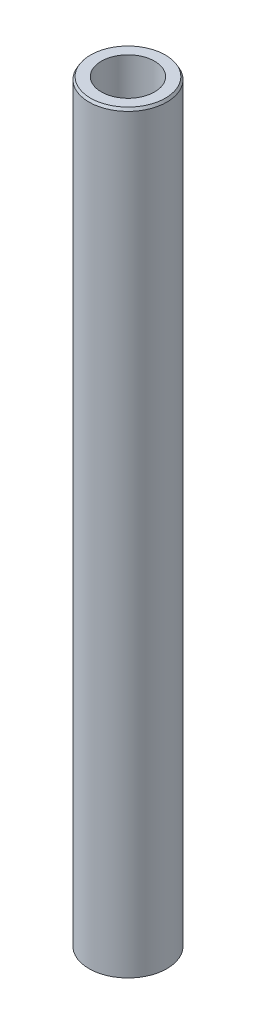
ISO-10303-21;
HEADER;
FILE_DESCRIPTION(('STEP AP214'),'2;1');
FILE_NAME('part.step','',(''),(''),'','','');
FILE_SCHEMA(('AUTOMOTIVE_DESIGN { 1 0 10303 214 1 1 1 1 }'));
ENDSEC;
DATA;
#1=APPLICATION_CONTEXT('core data for automotive mechanical design processes');
#2=APPLICATION_PROTOCOL_DEFINITION('international standard','automotive_design',2000,#1);
#3=PRODUCT_CONTEXT('',#1,'mechanical');
#4=PRODUCT('Part','Part','',(#3));
#5=PRODUCT_RELATED_PRODUCT_CATEGORY('part','',(#4));
#6=PRODUCT_DEFINITION_FORMATION('','',#4);
#7=PRODUCT_DEFINITION_CONTEXT('part definition',#1,'design');
#8=PRODUCT_DEFINITION('design','',#6,#7);
#9=PRODUCT_DEFINITION_SHAPE('','',#8);
#10=(LENGTH_UNIT() NAMED_UNIT(*) SI_UNIT(.MILLI.,.METRE.));
#11=(NAMED_UNIT(*) PLANE_ANGLE_UNIT() SI_UNIT($,.RADIAN.));
#12=(NAMED_UNIT(*) SI_UNIT($,.STERADIAN.) SOLID_ANGLE_UNIT());
#13=UNCERTAINTY_MEASURE_WITH_UNIT(LENGTH_MEASURE(1.E-05),#10,'distance_accuracy_value','');
#14=(GEOMETRIC_REPRESENTATION_CONTEXT(3) GLOBAL_UNCERTAINTY_ASSIGNED_CONTEXT((#13)) GLOBAL_UNIT_ASSIGNED_CONTEXT((#10,
#11,#12)) REPRESENTATION_CONTEXT('',''));
#15=CARTESIAN_POINT('',(0.,0.,0.));
#16=DIRECTION('',(0.,0.,1.));
#17=DIRECTION('',(1.,0.,0.));
#18=AXIS2_PLACEMENT_3D('',#15,#16,#17);
#19=CARTESIAN_POINT('',(0.,532.825089963925,0.));
#20=DIRECTION('',(0.,-1.,0.));
#21=DIRECTION('',(0.,0.,-1.));
#22=AXIS2_PLACEMENT_3D('',#19,#20,#21);
#23=CYLINDRICAL_SURFACE('',#22,27.5);
#24=CARTESIAN_POINT('',(0.,530.950162846745,0.));
#25=DIRECTION('',(0.,1.,0.));
#26=DIRECTION('',(0.,0.,1.));
#27=AXIS2_PLACEMENT_3D('',#24,#25,#26);
#28=CIRCLE('',#27,27.5);
#29=CARTESIAN_POINT('',(0.,530.950162846745,27.5));
#30=VERTEX_POINT('',#29);
#31=EDGE_CURVE('E50',#30,#30,#28,.F.);
#32=ORIENTED_EDGE('',*,*,#31,.T.);
#33=EDGE_LOOP('',(#32));
#34=FACE_BOUND('',#33,.T.);
#35=CARTESIAN_POINT('',(0.,1.08248967581448,0.));
#36=DIRECTION('',(0.,1.,0.));
#37=DIRECTION('',(0.,0.,1.));
#38=AXIS2_PLACEMENT_3D('',#35,#36,#37);
#39=CIRCLE('',#38,27.5);
#40=CARTESIAN_POINT('',(0.,1.08248967581448,27.5));
#41=VERTEX_POINT('',#40);
#42=EDGE_CURVE('E51',#41,#41,#39,.T.);
#43=ORIENTED_EDGE('',*,*,#42,.T.);
#44=EDGE_LOOP('',(#43));
#45=FACE_BOUND('',#44,.T.);
#46=ADVANCED_FACE('F39',(#34,#45),#23,.T.);
#47=CARTESIAN_POINT('',(0.,532.825089963925,0.));
#48=DIRECTION('',(0.,1.,0.));
#49=DIRECTION('',(0.,0.,1.));
#50=AXIS2_PLACEMENT_3D('',#47,#48,#49);
#51=PLANE('',#50);
#52=CARTESIAN_POINT('',(0.,532.825089963925,0.));
#53=DIRECTION('',(0.,1.,0.));
#54=DIRECTION('',(0.,0.,1.));
#55=AXIS2_PLACEMENT_3D('',#52,#53,#54);
#56=CIRCLE('',#55,26.4175103241855);
#57=CARTESIAN_POINT('',(0.,532.825089963925,26.4175103241855));
#58=VERTEX_POINT('',#57);
#59=EDGE_CURVE('E54',#58,#58,#56,.T.);
#60=ORIENTED_EDGE('',*,*,#59,.T.);
#61=EDGE_LOOP('',(#60));
#62=FACE_BOUND('',#61,.T.);
#63=CARTESIAN_POINT('',(0.,532.825089963925,0.));
#64=DIRECTION('',(0.,1.,0.));
#65=DIRECTION('',(0.,0.,1.));
#66=AXIS2_PLACEMENT_3D('',#63,#64,#65);
#67=CIRCLE('',#66,18.8214747306708);
#68=CARTESIAN_POINT('',(0.,532.825089963925,18.8214747306708));
#69=VERTEX_POINT('',#68);
#70=EDGE_CURVE('E58',#69,#69,#67,.T.);
#71=ORIENTED_EDGE('',*,*,#70,.F.);
#72=EDGE_LOOP('',(#71));
#73=FACE_BOUND('',#72,.T.);
#74=ADVANCED_FACE('F69',(#62,#73),#51,.T.);
#75=CARTESIAN_POINT('',(0.,0.,0.));
#76=DIRECTION('',(0.,1.,0.));
#77=DIRECTION('',(0.,0.,1.));
#78=AXIS2_PLACEMENT_3D('',#75,#76,#77);
#79=PLANE('',#78);
#80=CARTESIAN_POINT('',(0.,0.,0.));
#81=DIRECTION('',(0.,1.,0.));
#82=DIRECTION('',(0.,0.,1.));
#83=AXIS2_PLACEMENT_3D('',#80,#81,#82);
#84=CIRCLE('',#83,25.6250728828205);
#85=CARTESIAN_POINT('',(0.,0.,25.6250728828205));
#86=VERTEX_POINT('',#85);
#87=EDGE_CURVE('E10',#86,#86,#84,.F.);
#88=ORIENTED_EDGE('',*,*,#87,.T.);
#89=EDGE_LOOP('',(#88));
#90=FACE_BOUND('',#89,.T.);
#91=CARTESIAN_POINT('',(0.,0.,0.));
#92=DIRECTION('',(0.,1.,0.));
#93=DIRECTION('',(0.,0.,1.));
#94=AXIS2_PLACEMENT_3D('',#91,#92,#93);
#95=CIRCLE('',#94,18.8214747306708);
#96=CARTESIAN_POINT('',(0.,0.,18.8214747306708));
#97=VERTEX_POINT('',#96);
#98=EDGE_CURVE('E63',#97,#97,#95,.T.);
#99=ORIENTED_EDGE('',*,*,#98,.T.);
#100=EDGE_LOOP('',(#99));
#101=FACE_BOUND('',#100,.T.);
#102=ADVANCED_FACE('F75',(#90,#101),#79,.F.);
#103=CARTESIAN_POINT('',(0.,532.825089963925,0.));
#104=DIRECTION('',(0.,-1.,0.));
#105=DIRECTION('',(0.,0.,-1.));
#106=AXIS2_PLACEMENT_3D('',#103,#104,#105);
#107=CYLINDRICAL_SURFACE('',#106,18.8214747306708);
#108=ORIENTED_EDGE('',*,*,#70,.T.);
#109=EDGE_LOOP('',(#108));
#110=FACE_BOUND('',#109,.T.);
#111=ORIENTED_EDGE('',*,*,#98,.F.);
#112=EDGE_LOOP('',(#111));
#113=FACE_BOUND('',#112,.T.);
#114=ADVANCED_FACE('F70',(#110,#113),#107,.F.);
#115=CARTESIAN_POINT('',(0.,532.825089963925,0.));
#116=DIRECTION('',(0.,-1.,0.));
#117=DIRECTION('',(0.,0.,-1.));
#118=AXIS2_PLACEMENT_3D('',#115,#116,#117);
#119=CONICAL_SURFACE('',#118,26.4175103241855,0.52359877559827);
#120=ORIENTED_EDGE('',*,*,#31,.F.);
#121=EDGE_LOOP('',(#120));
#122=FACE_BOUND('',#121,.T.);
#123=ORIENTED_EDGE('',*,*,#59,.F.);
#124=EDGE_LOOP('',(#123));
#125=FACE_BOUND('',#124,.T.);
#126=ADVANCED_FACE('F81',(#122,#125),#119,.T.);
#127=CARTESIAN_POINT('',(0.,1.08248967581448,0.));
#128=DIRECTION('',(0.,1.,0.));
#129=DIRECTION('',(0.,0.,1.));
#130=AXIS2_PLACEMENT_3D('',#127,#128,#129);
#131=CONICAL_SURFACE('',#130,27.5,1.04719755119661);
#132=ORIENTED_EDGE('',*,*,#87,.F.);
#133=EDGE_LOOP('',(#132));
#134=FACE_BOUND('',#133,.T.);
#135=ORIENTED_EDGE('',*,*,#42,.F.);
#136=EDGE_LOOP('',(#135));
#137=FACE_BOUND('',#136,.T.);
#138=ADVANCED_FACE('F45',(#134,#137),#131,.T.);
#139=CLOSED_SHELL('',(#46,#74,#102,#114,#126,#138));
#140=MANIFOLD_SOLID_BREP('B2',#139);
#141=ADVANCED_BREP_SHAPE_REPRESENTATION('',(#18,#140),#14);
#142=SHAPE_DEFINITION_REPRESENTATION(#9,#141);
ENDSEC;
END-ISO-10303-21;
